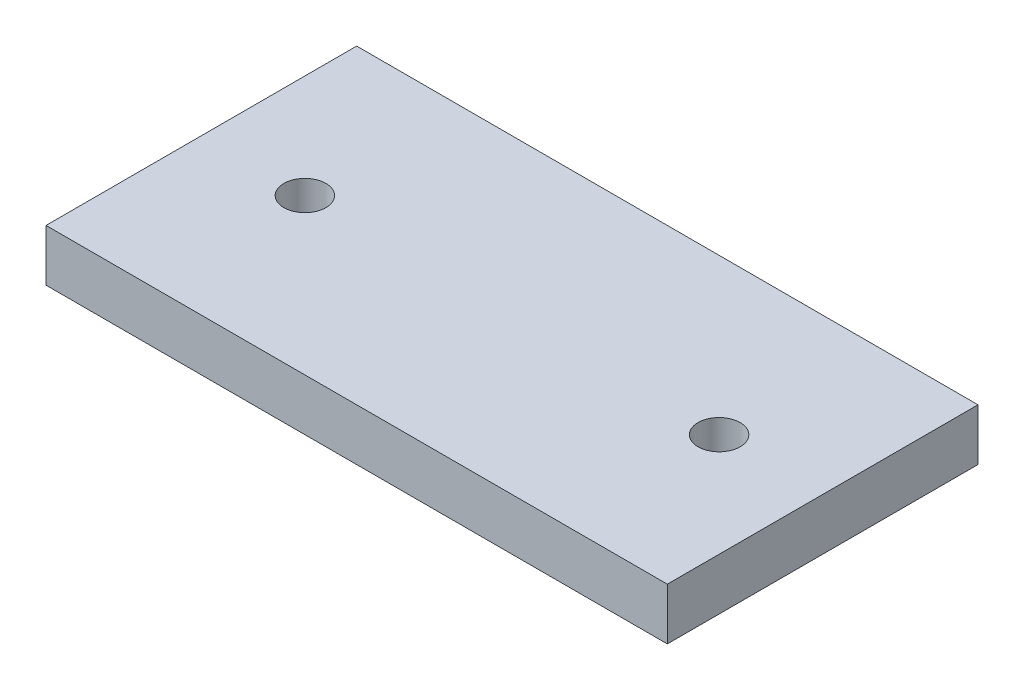
ISO-10303-21;
HEADER;
FILE_DESCRIPTION(('STEP AP214'),'2;1');
FILE_NAME('part.step','',(''),(''),'','','');
FILE_SCHEMA(('AUTOMOTIVE_DESIGN { 1 0 10303 214 1 1 1 1 }'));
ENDSEC;
DATA;
#1=APPLICATION_CONTEXT('core data for automotive mechanical design processes');
#2=APPLICATION_PROTOCOL_DEFINITION('international standard','automotive_design',2000,#1);
#3=PRODUCT_CONTEXT('',#1,'mechanical');
#4=PRODUCT('Part','Part','',(#3));
#5=PRODUCT_RELATED_PRODUCT_CATEGORY('part','',(#4));
#6=PRODUCT_DEFINITION_FORMATION('','',#4);
#7=PRODUCT_DEFINITION_CONTEXT('part definition',#1,'design');
#8=PRODUCT_DEFINITION('design','',#6,#7);
#9=PRODUCT_DEFINITION_SHAPE('','',#8);
#10=(LENGTH_UNIT() NAMED_UNIT(*) SI_UNIT(.MILLI.,.METRE.));
#11=(NAMED_UNIT(*) PLANE_ANGLE_UNIT() SI_UNIT($,.RADIAN.));
#12=(NAMED_UNIT(*) SI_UNIT($,.STERADIAN.) SOLID_ANGLE_UNIT());
#13=UNCERTAINTY_MEASURE_WITH_UNIT(LENGTH_MEASURE(1.E-05),#10,'distance_accuracy_value','');
#14=(GEOMETRIC_REPRESENTATION_CONTEXT(3) GLOBAL_UNCERTAINTY_ASSIGNED_CONTEXT((#13)) GLOBAL_UNIT_ASSIGNED_CONTEXT((#10,
#11,#12)) REPRESENTATION_CONTEXT('',''));
#15=CARTESIAN_POINT('',(0.,0.,0.));
#16=DIRECTION('',(0.,0.,1.));
#17=DIRECTION('',(1.,0.,0.));
#18=AXIS2_PLACEMENT_3D('',#15,#16,#17);
#19=CARTESIAN_POINT('',(0.,25.4,-152.4));
#20=DIRECTION('',(0.,-1.,0.));
#21=DIRECTION('',(0.,0.,-1.));
#22=AXIS2_PLACEMENT_3D('',#19,#20,#21);
#23=PLANE('',#22);
#24=CARTESIAN_POINT('',(50.8,25.4,-76.2));
#25=DIRECTION('',(0.,1.,0.));
#26=DIRECTION('',(0.,0.,1.));
#27=AXIS2_PLACEMENT_3D('',#24,#25,#26);
#28=CIRCLE('',#27,10.31875);
#29=CARTESIAN_POINT('',(50.8,25.4,-65.88125));
#30=VERTEX_POINT('',#29);
#31=EDGE_CURVE('E101',#30,#30,#28,.T.);
#32=ORIENTED_EDGE('',*,*,#31,.F.);
#33=EDGE_LOOP('',(#32));
#34=FACE_BOUND('',#33,.T.);
#35=DIRECTION('',(0.,0.,1.));
#36=VECTOR('',#35,1.);
#37=CARTESIAN_POINT('',(0.,25.4,0.));
#38=LINE('',#37,#36);
#39=CARTESIAN_POINT('',(0.,25.4,-152.4));
#40=VERTEX_POINT('',#39);
#41=CARTESIAN_POINT('',(0.,25.4,0.));
#42=VERTEX_POINT('',#41);
#43=EDGE_CURVE('E86',#40,#42,#38,.T.);
#44=ORIENTED_EDGE('',*,*,#43,.T.);
#45=DIRECTION('',(1.,0.,0.));
#46=VECTOR('',#45,1.);
#47=CARTESIAN_POINT('',(0.,25.4,0.));
#48=LINE('',#47,#46);
#49=CARTESIAN_POINT('',(304.8,25.4,0.));
#50=VERTEX_POINT('',#49);
#51=EDGE_CURVE('E81',#42,#50,#48,.T.);
#52=ORIENTED_EDGE('',*,*,#51,.T.);
#53=DIRECTION('',(0.,0.,-1.));
#54=VECTOR('',#53,1.);
#55=CARTESIAN_POINT('',(304.8,25.4,0.));
#56=LINE('',#55,#54);
#57=CARTESIAN_POINT('',(304.8,25.4,-152.4));
#58=VERTEX_POINT('',#57);
#59=EDGE_CURVE('E84',#50,#58,#56,.T.);
#60=ORIENTED_EDGE('',*,*,#59,.T.);
#61=DIRECTION('',(-1.,0.,0.));
#62=VECTOR('',#61,1.);
#63=CARTESIAN_POINT('',(0.,25.4,-152.4));
#64=LINE('',#63,#62);
#65=EDGE_CURVE('E51',#58,#40,#64,.T.);
#66=ORIENTED_EDGE('',*,*,#65,.T.);
#67=EDGE_LOOP('',(#44,#52,#60,#66));
#68=FACE_BOUND('',#67,.T.);
#69=CARTESIAN_POINT('',(254.,25.4,-76.2));
#70=DIRECTION('',(0.,1.,0.));
#71=DIRECTION('',(0.,0.,1.));
#72=AXIS2_PLACEMENT_3D('',#69,#70,#71);
#73=CIRCLE('',#72,10.31875);
#74=CARTESIAN_POINT('',(254.,25.4,-65.88125));
#75=VERTEX_POINT('',#74);
#76=EDGE_CURVE('E116',#75,#75,#73,.T.);
#77=ORIENTED_EDGE('',*,*,#76,.F.);
#78=EDGE_LOOP('',(#77));
#79=FACE_BOUND('',#78,.T.);
#80=ADVANCED_FACE('F34',(#34,#68,#79),#23,.F.);
#81=CARTESIAN_POINT('',(0.,0.,-152.4));
#82=DIRECTION('',(0.,-1.,0.));
#83=DIRECTION('',(0.,0.,-1.));
#84=AXIS2_PLACEMENT_3D('',#81,#82,#83);
#85=PLANE('',#84);
#86=CARTESIAN_POINT('',(50.8,0.,-76.2));
#87=DIRECTION('',(0.,1.,0.));
#88=DIRECTION('',(0.,0.,1.));
#89=AXIS2_PLACEMENT_3D('',#86,#87,#88);
#90=CIRCLE('',#89,10.31875);
#91=CARTESIAN_POINT('',(50.8,0.,-65.88125));
#92=VERTEX_POINT('',#91);
#93=EDGE_CURVE('E113',#92,#92,#90,.T.);
#94=ORIENTED_EDGE('',*,*,#93,.T.);
#95=EDGE_LOOP('',(#94));
#96=FACE_BOUND('',#95,.T.);
#97=DIRECTION('',(0.,0.,1.));
#98=VECTOR('',#97,1.);
#99=CARTESIAN_POINT('',(0.,0.,0.));
#100=LINE('',#99,#98);
#101=CARTESIAN_POINT('',(0.,0.,-152.4));
#102=VERTEX_POINT('',#101);
#103=CARTESIAN_POINT('',(0.,0.,0.));
#104=VERTEX_POINT('',#103);
#105=EDGE_CURVE('E98',#102,#104,#100,.T.);
#106=ORIENTED_EDGE('',*,*,#105,.F.);
#107=DIRECTION('',(-1.,0.,0.));
#108=VECTOR('',#107,1.);
#109=CARTESIAN_POINT('',(0.,0.,-152.4));
#110=LINE('',#109,#108);
#111=CARTESIAN_POINT('',(304.8,0.,-152.4));
#112=VERTEX_POINT('',#111);
#113=EDGE_CURVE('E74',#112,#102,#110,.T.);
#114=ORIENTED_EDGE('',*,*,#113,.F.);
#115=DIRECTION('',(0.,0.,-1.));
#116=VECTOR('',#115,1.);
#117=CARTESIAN_POINT('',(304.8,0.,0.));
#118=LINE('',#117,#116);
#119=CARTESIAN_POINT('',(304.8,0.,0.));
#120=VERTEX_POINT('',#119);
#121=EDGE_CURVE('E68',#120,#112,#118,.T.);
#122=ORIENTED_EDGE('',*,*,#121,.F.);
#123=DIRECTION('',(1.,0.,0.));
#124=VECTOR('',#123,1.);
#125=CARTESIAN_POINT('',(0.,0.,0.));
#126=LINE('',#125,#124);
#127=EDGE_CURVE('E90',#104,#120,#126,.T.);
#128=ORIENTED_EDGE('',*,*,#127,.F.);
#129=EDGE_LOOP('',(#106,#114,#122,#128));
#130=FACE_BOUND('',#129,.T.);
#131=CARTESIAN_POINT('',(254.,0.,-76.2));
#132=DIRECTION('',(0.,1.,0.));
#133=DIRECTION('',(0.,0.,1.));
#134=AXIS2_PLACEMENT_3D('',#131,#132,#133);
#135=CIRCLE('',#134,10.31875);
#136=CARTESIAN_POINT('',(254.,0.,-65.88125));
#137=VERTEX_POINT('',#136);
#138=EDGE_CURVE('E119',#137,#137,#135,.T.);
#139=ORIENTED_EDGE('',*,*,#138,.T.);
#140=EDGE_LOOP('',(#139));
#141=FACE_BOUND('',#140,.T.);
#142=ADVANCED_FACE('F109',(#96,#130,#141),#85,.T.);
#143=CARTESIAN_POINT('',(0.,25.4,0.));
#144=DIRECTION('',(1.,0.,0.));
#145=DIRECTION('',(0.,0.,-1.));
#146=AXIS2_PLACEMENT_3D('',#143,#144,#145);
#147=PLANE('',#146);
#148=ORIENTED_EDGE('',*,*,#105,.T.);
#149=DIRECTION('',(0.,-1.,0.));
#150=VECTOR('',#149,1.);
#151=CARTESIAN_POINT('',(0.,25.4,0.));
#152=LINE('',#151,#150);
#153=EDGE_CURVE('E11',#42,#104,#152,.T.);
#154=ORIENTED_EDGE('',*,*,#153,.F.);
#155=ORIENTED_EDGE('',*,*,#43,.F.);
#156=DIRECTION('',(0.,-1.,0.));
#157=VECTOR('',#156,1.);
#158=CARTESIAN_POINT('',(0.,25.4,-152.4));
#159=LINE('',#158,#157);
#160=EDGE_CURVE('E94',#40,#102,#159,.T.);
#161=ORIENTED_EDGE('',*,*,#160,.T.);
#162=EDGE_LOOP('',(#148,#154,#155,#161));
#163=FACE_BOUND('',#162,.T.);
#164=ADVANCED_FACE('F36',(#163),#147,.F.);
#165=CARTESIAN_POINT('',(0.,25.4,0.));
#166=DIRECTION('',(0.,0.,-1.));
#167=DIRECTION('',(-1.,0.,0.));
#168=AXIS2_PLACEMENT_3D('',#165,#166,#167);
#169=PLANE('',#168);
#170=ORIENTED_EDGE('',*,*,#127,.T.);
#171=DIRECTION('',(0.,-1.,0.));
#172=VECTOR('',#171,1.);
#173=CARTESIAN_POINT('',(304.8,25.4,0.));
#174=LINE('',#173,#172);
#175=EDGE_CURVE('E43',#50,#120,#174,.T.);
#176=ORIENTED_EDGE('',*,*,#175,.F.);
#177=ORIENTED_EDGE('',*,*,#51,.F.);
#178=ORIENTED_EDGE('',*,*,#153,.T.);
#179=EDGE_LOOP('',(#170,#176,#177,#178));
#180=FACE_BOUND('',#179,.T.);
#181=ADVANCED_FACE('F89',(#180),#169,.F.);
#182=CARTESIAN_POINT('',(304.8,25.4,0.));
#183=DIRECTION('',(-1.,0.,0.));
#184=DIRECTION('',(0.,0.,1.));
#185=AXIS2_PLACEMENT_3D('',#182,#183,#184);
#186=PLANE('',#185);
#187=ORIENTED_EDGE('',*,*,#121,.T.);
#188=DIRECTION('',(0.,-1.,0.));
#189=VECTOR('',#188,1.);
#190=CARTESIAN_POINT('',(304.8,25.4,-152.4));
#191=LINE('',#190,#189);
#192=EDGE_CURVE('E91',#58,#112,#191,.T.);
#193=ORIENTED_EDGE('',*,*,#192,.F.);
#194=ORIENTED_EDGE('',*,*,#59,.F.);
#195=ORIENTED_EDGE('',*,*,#175,.T.);
#196=EDGE_LOOP('',(#187,#193,#194,#195));
#197=FACE_BOUND('',#196,.T.);
#198=ADVANCED_FACE('F92',(#197),#186,.F.);
#199=CARTESIAN_POINT('',(0.,25.4,-152.4));
#200=DIRECTION('',(0.,0.,1.));
#201=DIRECTION('',(1.,0.,0.));
#202=AXIS2_PLACEMENT_3D('',#199,#200,#201);
#203=PLANE('',#202);
#204=ORIENTED_EDGE('',*,*,#113,.T.);
#205=ORIENTED_EDGE('',*,*,#160,.F.);
#206=ORIENTED_EDGE('',*,*,#65,.F.);
#207=ORIENTED_EDGE('',*,*,#192,.T.);
#208=EDGE_LOOP('',(#204,#205,#206,#207));
#209=FACE_BOUND('',#208,.T.);
#210=ADVANCED_FACE('F106',(#209),#203,.F.);
#211=CARTESIAN_POINT('',(50.8,25.4,-76.2));
#212=DIRECTION('',(0.,-1.,0.));
#213=DIRECTION('',(0.,0.,-1.));
#214=AXIS2_PLACEMENT_3D('',#211,#212,#213);
#215=CYLINDRICAL_SURFACE('',#214,10.31875);
#216=ORIENTED_EDGE('',*,*,#31,.T.);
#217=EDGE_LOOP('',(#216));
#218=FACE_BOUND('',#217,.T.);
#219=ORIENTED_EDGE('',*,*,#93,.F.);
#220=EDGE_LOOP('',(#219));
#221=FACE_BOUND('',#220,.T.);
#222=ADVANCED_FACE('F137',(#218,#221),#215,.F.);
#223=CARTESIAN_POINT('',(254.,25.4,-76.2));
#224=DIRECTION('',(0.,-1.,0.));
#225=DIRECTION('',(0.,0.,-1.));
#226=AXIS2_PLACEMENT_3D('',#223,#224,#225);
#227=CYLINDRICAL_SURFACE('',#226,10.31875);
#228=ORIENTED_EDGE('',*,*,#76,.T.);
#229=EDGE_LOOP('',(#228));
#230=FACE_BOUND('',#229,.T.);
#231=ORIENTED_EDGE('',*,*,#138,.F.);
#232=EDGE_LOOP('',(#231));
#233=FACE_BOUND('',#232,.T.);
#234=ADVANCED_FACE('F125',(#230,#233),#227,.F.);
#235=CLOSED_SHELL('',(#80,#142,#164,#181,#198,#210,#222,#234));
#236=MANIFOLD_SOLID_BREP('B2',#235);
#237=ADVANCED_BREP_SHAPE_REPRESENTATION('',(#18,#236),#14);
#238=SHAPE_DEFINITION_REPRESENTATION(#9,#237);
ENDSEC;
END-ISO-10303-21;
